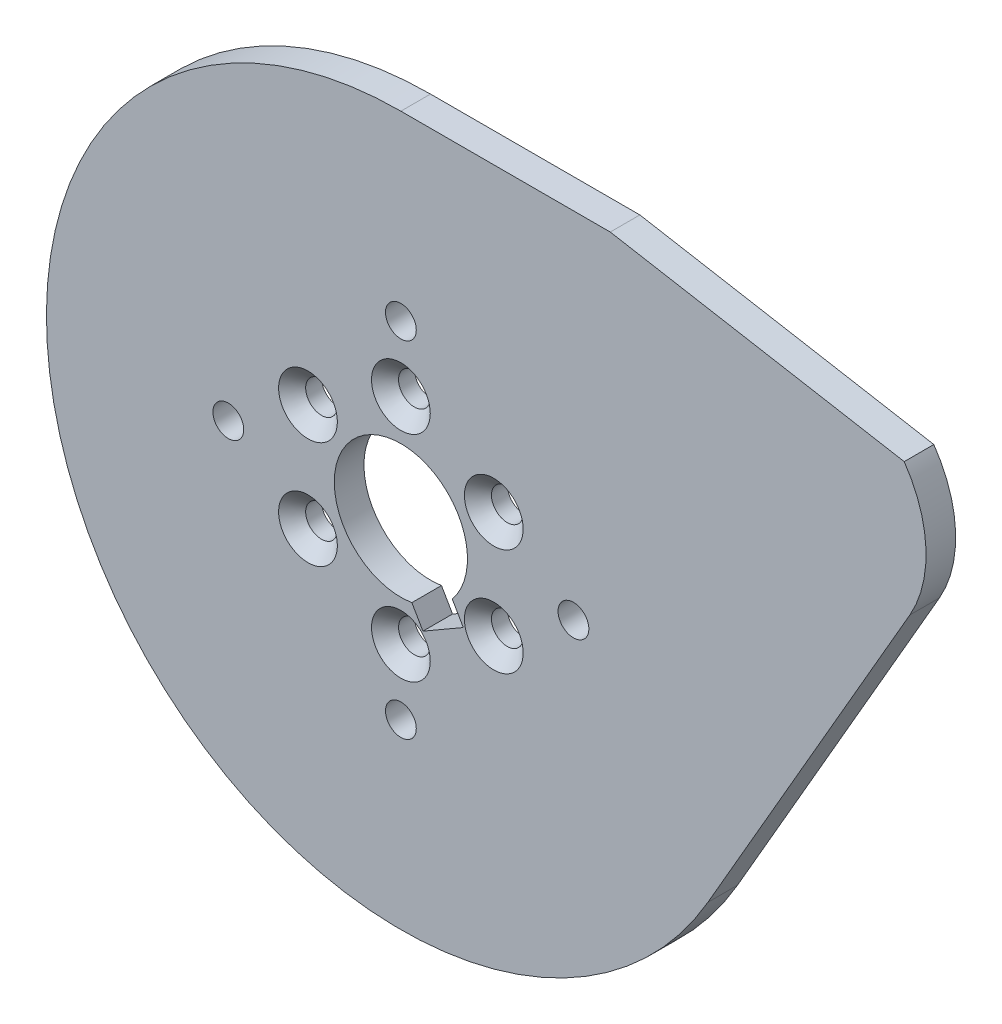
ISO-10303-21;
HEADER;
FILE_DESCRIPTION(('STEP AP214'),'2;1');
FILE_NAME('part.step','',(''),(''),'','','');
FILE_SCHEMA(('AUTOMOTIVE_DESIGN { 1 0 10303 214 1 1 1 1 }'));
ENDSEC;
DATA;
#1=APPLICATION_CONTEXT('core data for automotive mechanical design processes');
#2=APPLICATION_PROTOCOL_DEFINITION('international standard','automotive_design',2000,#1);
#3=PRODUCT_CONTEXT('',#1,'mechanical');
#4=PRODUCT('Part','Part','',(#3));
#5=PRODUCT_RELATED_PRODUCT_CATEGORY('part','',(#4));
#6=PRODUCT_DEFINITION_FORMATION('','',#4);
#7=PRODUCT_DEFINITION_CONTEXT('part definition',#1,'design');
#8=PRODUCT_DEFINITION('design','',#6,#7);
#9=PRODUCT_DEFINITION_SHAPE('','',#8);
#10=(LENGTH_UNIT() NAMED_UNIT(*) SI_UNIT(.MILLI.,.METRE.));
#11=(NAMED_UNIT(*) PLANE_ANGLE_UNIT() SI_UNIT($,.RADIAN.));
#12=(NAMED_UNIT(*) SI_UNIT($,.STERADIAN.) SOLID_ANGLE_UNIT());
#13=UNCERTAINTY_MEASURE_WITH_UNIT(LENGTH_MEASURE(1.E-05),#10,'distance_accuracy_value','');
#14=(GEOMETRIC_REPRESENTATION_CONTEXT(3) GLOBAL_UNCERTAINTY_ASSIGNED_CONTEXT((#13)) GLOBAL_UNIT_ASSIGNED_CONTEXT((#10,
#11,#12)) REPRESENTATION_CONTEXT('',''));
#15=CARTESIAN_POINT('',(0.,0.,0.));
#16=DIRECTION('',(0.,0.,1.));
#17=DIRECTION('',(1.,0.,0.));
#18=AXIS2_PLACEMENT_3D('',#15,#16,#17);
#19=CARTESIAN_POINT('',(0.,1.23512311489549E-12,0.));
#20=DIRECTION('',(0.,0.,1.));
#21=DIRECTION('',(1.,0.,0.));
#22=AXIS2_PLACEMENT_3D('',#19,#20,#21);
#23=CYLINDRICAL_SURFACE('',#22,38.0000000000004);
#24=CARTESIAN_POINT('',(0.,1.23512311489549E-12,3.175));
#25=DIRECTION('',(0.,0.,1.));
#26=DIRECTION('',(1.,0.,0.));
#27=AXIS2_PLACEMENT_3D('',#24,#25,#26);
#28=CIRCLE('',#27,38.0000000000004);
#29=CARTESIAN_POINT('',(0.,38.0000000000014,3.175));
#30=VERTEX_POINT('',#29);
#31=CARTESIAN_POINT('',(32.9089653438092,-18.9999999999992,3.175));
#32=VERTEX_POINT('',#31);
#33=EDGE_CURVE('E111',#30,#32,#28,.T.);
#34=ORIENTED_EDGE('',*,*,#33,.F.);
#35=DIRECTION('',(0.,0.,1.));
#36=VECTOR('',#35,1.);
#37=CARTESIAN_POINT('',(0.,38.0000000000014,0.));
#38=LINE('',#37,#36);
#39=CARTESIAN_POINT('',(0.,38.0000000000014,0.));
#40=VERTEX_POINT('',#39);
#41=EDGE_CURVE('E11',#40,#30,#38,.T.);
#42=ORIENTED_EDGE('',*,*,#41,.F.);
#43=CARTESIAN_POINT('',(0.,1.23512311489549E-12,0.));
#44=DIRECTION('',(0.,0.,1.));
#45=DIRECTION('',(1.,0.,0.));
#46=AXIS2_PLACEMENT_3D('',#43,#44,#45);
#47=CIRCLE('',#46,38.0000000000004);
#48=CARTESIAN_POINT('',(32.9089653438092,-18.9999999999992,0.));
#49=VERTEX_POINT('',#48);
#50=EDGE_CURVE('E141',#40,#49,#47,.T.);
#51=ORIENTED_EDGE('',*,*,#50,.T.);
#52=DIRECTION('',(0.,0.,1.));
#53=VECTOR('',#52,1.);
#54=CARTESIAN_POINT('',(32.9089653438092,-18.9999999999992,0.));
#55=LINE('',#54,#53);
#56=EDGE_CURVE('E37',#49,#32,#55,.T.);
#57=ORIENTED_EDGE('',*,*,#56,.T.);
#58=EDGE_LOOP('',(#34,#42,#51,#57));
#59=FACE_BOUND('',#58,.T.);
#60=ADVANCED_FACE('F34',(#59),#23,.T.);
#61=CARTESIAN_POINT('',(22.4456539190408,38.0000000000013,0.));
#62=DIRECTION('',(0.,1.,0.));
#63=DIRECTION('',(-1.,0.,0.));
#64=AXIS2_PLACEMENT_3D('',#61,#62,#63);
#65=PLANE('',#64);
#66=DIRECTION('',(-1.,0.,0.));
#67=VECTOR('',#66,1.);
#68=CARTESIAN_POINT('',(22.4456539190408,38.0000000000013,3.175));
#69=LINE('',#68,#67);
#70=CARTESIAN_POINT('',(22.4456539190408,38.0000000000013,3.175));
#71=VERTEX_POINT('',#70);
#72=EDGE_CURVE('E145',#71,#30,#69,.T.);
#73=ORIENTED_EDGE('',*,*,#72,.F.);
#74=DIRECTION('',(0.,0.,1.));
#75=VECTOR('',#74,1.);
#76=CARTESIAN_POINT('',(22.4456539190408,38.0000000000013,0.));
#77=LINE('',#76,#75);
#78=CARTESIAN_POINT('',(22.4456539190408,38.0000000000013,0.));
#79=VERTEX_POINT('',#78);
#80=EDGE_CURVE('E42',#79,#71,#77,.T.);
#81=ORIENTED_EDGE('',*,*,#80,.F.);
#82=DIRECTION('',(-1.,0.,0.));
#83=VECTOR('',#82,1.);
#84=CARTESIAN_POINT('',(22.4456539190408,38.0000000000013,0.));
#85=LINE('',#84,#83);
#86=EDGE_CURVE('E154',#79,#40,#85,.T.);
#87=ORIENTED_EDGE('',*,*,#86,.T.);
#88=ORIENTED_EDGE('',*,*,#41,.T.);
#89=EDGE_LOOP('',(#73,#81,#87,#88));
#90=FACE_BOUND('',#89,.T.);
#91=ADVANCED_FACE('F186',(#90),#65,.T.);
#92=CARTESIAN_POINT('',(53.9595020154317,32.4432583146595,0.));
#93=DIRECTION('',(0.173648177666931,0.984807753012208,0.));
#94=DIRECTION('',(-0.984807753012208,0.173648177666931,0.));
#95=AXIS2_PLACEMENT_3D('',#92,#93,#94);
#96=PLANE('',#95);
#97=DIRECTION('',(-0.984807753012208,0.173648177666931,0.));
#98=VECTOR('',#97,1.);
#99=CARTESIAN_POINT('',(53.9595020154317,32.4432583146595,3.175));
#100=LINE('',#99,#98);
#101=CARTESIAN_POINT('',(53.9595020154317,32.4432583146595,3.175));
#102=VERTEX_POINT('',#101);
#103=EDGE_CURVE('E165',#102,#71,#100,.T.);
#104=ORIENTED_EDGE('',*,*,#103,.F.);
#105=DIRECTION('',(0.,0.,1.));
#106=VECTOR('',#105,1.);
#107=CARTESIAN_POINT('',(53.9595020154317,32.4432583146595,0.));
#108=LINE('',#107,#106);
#109=CARTESIAN_POINT('',(53.9595020154317,32.4432583146595,0.));
#110=VERTEX_POINT('',#109);
#111=EDGE_CURVE('E171',#110,#102,#108,.T.);
#112=ORIENTED_EDGE('',*,*,#111,.F.);
#113=DIRECTION('',(-0.984807753012208,0.173648177666931,0.));
#114=VECTOR('',#113,1.);
#115=CARTESIAN_POINT('',(53.9595020154317,32.4432583146595,0.));
#116=LINE('',#115,#114);
#117=EDGE_CURVE('E151',#110,#79,#116,.T.);
#118=ORIENTED_EDGE('',*,*,#117,.T.);
#119=ORIENTED_EDGE('',*,*,#80,.T.);
#120=EDGE_LOOP('',(#104,#112,#118,#119));
#121=FACE_BOUND('',#120,.T.);
#122=ADVANCED_FACE('F193',(#121),#96,.T.);
#123=CARTESIAN_POINT('',(43.3012701892193,24.9999999999999,0.));
#124=DIRECTION('',(0.,0.,1.));
#125=DIRECTION('',(1.,0.,0.));
#126=AXIS2_PLACEMENT_3D('',#123,#124,#125);
#127=CYLINDRICAL_SURFACE('',#126,13.0000000000015);
#128=CARTESIAN_POINT('',(43.3012701892193,24.9999999999999,3.175));
#129=DIRECTION('',(0.,0.,1.));
#130=DIRECTION('',(1.,0.,0.));
#131=AXIS2_PLACEMENT_3D('',#128,#129,#130);
#132=CIRCLE('',#131,13.0000000000015);
#133=CARTESIAN_POINT('',(54.5596004384183,18.4999999999993,3.175));
#134=VERTEX_POINT('',#133);
#135=EDGE_CURVE('E162',#134,#102,#132,.T.);
#136=ORIENTED_EDGE('',*,*,#135,.F.);
#137=DIRECTION('',(0.,0.,1.));
#138=VECTOR('',#137,1.);
#139=CARTESIAN_POINT('',(54.5596004384183,18.4999999999993,0.));
#140=LINE('',#139,#138);
#141=CARTESIAN_POINT('',(54.5596004384183,18.4999999999993,0.));
#142=VERTEX_POINT('',#141);
#143=EDGE_CURVE('E172',#142,#134,#140,.T.);
#144=ORIENTED_EDGE('',*,*,#143,.F.);
#145=CARTESIAN_POINT('',(43.3012701892193,24.9999999999999,0.));
#146=DIRECTION('',(0.,0.,1.));
#147=DIRECTION('',(1.,0.,0.));
#148=AXIS2_PLACEMENT_3D('',#145,#146,#147);
#149=CIRCLE('',#148,13.0000000000015);
#150=EDGE_CURVE('E148',#142,#110,#149,.T.);
#151=ORIENTED_EDGE('',*,*,#150,.T.);
#152=ORIENTED_EDGE('',*,*,#111,.T.);
#153=EDGE_LOOP('',(#136,#144,#151,#152));
#154=FACE_BOUND('',#153,.T.);
#155=ADVANCED_FACE('F191',(#154),#127,.T.);
#156=CARTESIAN_POINT('',(32.9089653438092,-18.9999999999992,0.));
#157=DIRECTION('',(0.866025403784447,-0.499999999999986,0.));
#158=DIRECTION('',(0.499999999999986,0.866025403784447,0.));
#159=AXIS2_PLACEMENT_3D('',#156,#157,#158);
#160=PLANE('',#159);
#161=DIRECTION('',(0.499999999999986,0.866025403784447,0.));
#162=VECTOR('',#161,1.);
#163=CARTESIAN_POINT('',(32.9089653438092,-18.9999999999992,3.175));
#164=LINE('',#163,#162);
#165=EDGE_CURVE('E159',#32,#134,#164,.T.);
#166=ORIENTED_EDGE('',*,*,#165,.F.);
#167=ORIENTED_EDGE('',*,*,#56,.F.);
#168=DIRECTION('',(0.499999999999986,0.866025403784447,0.));
#169=VECTOR('',#168,1.);
#170=CARTESIAN_POINT('',(32.9089653438092,-18.9999999999992,0.));
#171=LINE('',#170,#169);
#172=EDGE_CURVE('E144',#49,#142,#171,.T.);
#173=ORIENTED_EDGE('',*,*,#172,.T.);
#174=ORIENTED_EDGE('',*,*,#143,.T.);
#175=EDGE_LOOP('',(#166,#167,#173,#174));
#176=FACE_BOUND('',#175,.T.);
#177=ADVANCED_FACE('F180',(#176),#160,.T.);
#178=CARTESIAN_POINT('',(0.,1.23512311489549E-12,0.));
#179=DIRECTION('',(0.,0.,1.));
#180=DIRECTION('',(1.,0.,0.));
#181=AXIS2_PLACEMENT_3D('',#178,#179,#180);
#182=PLANE('',#181);
#183=CARTESIAN_POINT('',(-9.95929214352075,5.74999999999949,0.));
#184=DIRECTION('',(0.,0.,1.));
#185=DIRECTION('',(1.,0.,0.));
#186=AXIS2_PLACEMENT_3D('',#183,#184,#185);
#187=CIRCLE('',#186,1.69999999999997);
#188=CARTESIAN_POINT('',(-8.25929214352077,5.74999999999949,0.));
#189=VERTEX_POINT('',#188);
#190=EDGE_CURVE('E451',#189,#189,#187,.T.);
#191=ORIENTED_EDGE('',*,*,#190,.T.);
#192=EDGE_LOOP('',(#191));
#193=FACE_BOUND('',#192,.T.);
#194=CARTESIAN_POINT('',(-9.95929214352015,-5.75000000000052,0.));
#195=DIRECTION('',(0.,0.,1.));
#196=DIRECTION('',(1.,0.,0.));
#197=AXIS2_PLACEMENT_3D('',#194,#195,#196);
#198=CIRCLE('',#197,1.69999999999997);
#199=CARTESIAN_POINT('',(-8.25929214352017,-5.75000000000052,0.));
#200=VERTEX_POINT('',#199);
#201=EDGE_CURVE('E462',#200,#200,#198,.T.);
#202=ORIENTED_EDGE('',*,*,#201,.T.);
#203=EDGE_LOOP('',(#202));
#204=FACE_BOUND('',#203,.T.);
#205=CARTESIAN_POINT('',(1.19132134712707E-12,-11.5,0.));
#206=DIRECTION('',(0.,0.,1.));
#207=DIRECTION('',(1.,0.,0.));
#208=AXIS2_PLACEMENT_3D('',#205,#206,#207);
#209=CIRCLE('',#208,1.69999999999997);
#210=CARTESIAN_POINT('',(1.70000000000116,-11.5,0.));
#211=VERTEX_POINT('',#210);
#212=EDGE_CURVE('E471',#211,#211,#209,.T.);
#213=ORIENTED_EDGE('',*,*,#212,.T.);
#214=EDGE_LOOP('',(#213));
#215=FACE_BOUND('',#214,.T.);
#216=CARTESIAN_POINT('',(9.95929214352194,-5.74999999999948,0.));
#217=DIRECTION('',(0.,0.,1.));
#218=DIRECTION('',(1.,0.,0.));
#219=AXIS2_PLACEMENT_3D('',#216,#217,#218);
#220=CIRCLE('',#219,1.69999999999997);
#221=CARTESIAN_POINT('',(11.6592921435219,-5.74999999999948,0.));
#222=VERTEX_POINT('',#221);
#223=EDGE_CURVE('E480',#222,#222,#220,.T.);
#224=ORIENTED_EDGE('',*,*,#223,.T.);
#225=EDGE_LOOP('',(#224));
#226=FACE_BOUND('',#225,.T.);
#227=CARTESIAN_POINT('',(9.95929214352134,5.75000000000052,0.));
#228=DIRECTION('',(0.,0.,1.));
#229=DIRECTION('',(1.,0.,0.));
#230=AXIS2_PLACEMENT_3D('',#227,#228,#229);
#231=CIRCLE('',#230,1.69999999999997);
#232=CARTESIAN_POINT('',(11.6592921435213,5.75000000000052,0.));
#233=VERTEX_POINT('',#232);
#234=EDGE_CURVE('E489',#233,#233,#231,.T.);
#235=ORIENTED_EDGE('',*,*,#234,.T.);
#236=EDGE_LOOP('',(#235));
#237=FACE_BOUND('',#236,.T.);
#238=CARTESIAN_POINT('',(0.,11.5,0.));
#239=DIRECTION('',(0.,0.,1.));
#240=DIRECTION('',(1.,0.,0.));
#241=AXIS2_PLACEMENT_3D('',#238,#239,#240);
#242=CIRCLE('',#241,1.69999999999997);
#243=CARTESIAN_POINT('',(1.69999999999997,11.5,0.));
#244=VERTEX_POINT('',#243);
#245=EDGE_CURVE('E498',#244,#244,#242,.T.);
#246=ORIENTED_EDGE('',*,*,#245,.T.);
#247=EDGE_LOOP('',(#246));
#248=FACE_BOUND('',#247,.T.);
#249=CARTESIAN_POINT('',(18.5000000000006,5.80012052705115E-13,0.));
#250=DIRECTION('',(0.,0.,1.));
#251=DIRECTION('',(1.,0.,0.));
#252=AXIS2_PLACEMENT_3D('',#249,#250,#251);
#253=CIRCLE('',#252,1.64999999999997);
#254=CARTESIAN_POINT('',(20.1500000000005,5.80012052705115E-13,0.));
#255=VERTEX_POINT('',#254);
#256=EDGE_CURVE('E504',#255,#255,#253,.T.);
#257=ORIENTED_EDGE('',*,*,#256,.T.);
#258=EDGE_LOOP('',(#257));
#259=FACE_BOUND('',#258,.T.);
#260=CARTESIAN_POINT('',(1.16002410541023E-12,-18.5,0.));
#261=DIRECTION('',(0.,0.,1.));
#262=DIRECTION('',(1.,0.,0.));
#263=AXIS2_PLACEMENT_3D('',#260,#261,#262);
#264=CIRCLE('',#263,1.64999999999997);
#265=CARTESIAN_POINT('',(1.65000000000113,-18.5,0.));
#266=VERTEX_POINT('',#265);
#267=EDGE_CURVE('E510',#266,#266,#264,.T.);
#268=ORIENTED_EDGE('',*,*,#267,.T.);
#269=EDGE_LOOP('',(#268));
#270=FACE_BOUND('',#269,.T.);
#271=CARTESIAN_POINT('',(-18.4999999999994,-5.82277649283538E-13,0.));
#272=DIRECTION('',(0.,0.,1.));
#273=DIRECTION('',(1.,0.,0.));
#274=AXIS2_PLACEMENT_3D('',#271,#272,#273);
#275=CIRCLE('',#274,1.64999999999997);
#276=CARTESIAN_POINT('',(-16.8499999999994,-5.82277649283538E-13,0.));
#277=VERTEX_POINT('',#276);
#278=EDGE_CURVE('E516',#277,#277,#275,.T.);
#279=ORIENTED_EDGE('',*,*,#278,.T.);
#280=EDGE_LOOP('',(#279));
#281=FACE_BOUND('',#280,.T.);
#282=CARTESIAN_POINT('',(0.,18.5,0.));
#283=DIRECTION('',(0.,0.,1.));
#284=DIRECTION('',(1.,0.,0.));
#285=AXIS2_PLACEMENT_3D('',#282,#283,#284);
#286=CIRCLE('',#285,1.64999999999997);
#287=CARTESIAN_POINT('',(1.64999999999997,18.5,0.));
#288=VERTEX_POINT('',#287);
#289=EDGE_CURVE('E123',#288,#288,#286,.T.);
#290=ORIENTED_EDGE('',*,*,#289,.T.);
#291=EDGE_LOOP('',(#290));
#292=FACE_BOUND('',#291,.T.);
#293=DIRECTION('',(0.500000000000065,-0.866025403784401,0.));
#294=VECTOR('',#293,1.);
#295=CARTESIAN_POINT('',(5.50768518862296,-4.53959057878827,0.));
#296=LINE('',#295,#294);
#297=CARTESIAN_POINT('',(5.50768518862296,-4.53959057878827,0.));
#298=VERTEX_POINT('',#297);
#299=CARTESIAN_POINT('',(6.69431345718396,-6.59489102963305,0.));
#300=VERTEX_POINT('',#299);
#301=EDGE_CURVE('E122',#298,#300,#296,.T.);
#302=ORIENTED_EDGE('',*,*,#301,.F.);
#303=CARTESIAN_POINT('',(0.,0.,0.));
#304=DIRECTION('',(0.,0.,-1.));
#305=DIRECTION('',(-1.,0.,0.));
#306=AXIS2_PLACEMENT_3D('',#303,#304,#305);
#307=CIRCLE('',#306,7.1374);
#308=CARTESIAN_POINT('',(1.17755816970101,-7.03959057878869,0.));
#309=VERTEX_POINT('',#308);
#310=EDGE_CURVE('E50',#309,#298,#307,.T.);
#311=ORIENTED_EDGE('',*,*,#310,.F.);
#312=DIRECTION('',(-0.5,0.866025403784439,0.));
#313=VECTOR('',#312,1.);
#314=CARTESIAN_POINT('',(2.36418643826161,-9.09489102963314,0.));
#315=LINE('',#314,#313);
#316=CARTESIAN_POINT('',(2.36418643826161,-9.09489102963314,0.));
#317=VERTEX_POINT('',#316);
#318=EDGE_CURVE('E120',#317,#309,#315,.T.);
#319=ORIENTED_EDGE('',*,*,#318,.F.);
#320=DIRECTION('',(-0.866025403784439,-0.5,0.));
#321=VECTOR('',#320,1.);
#322=CARTESIAN_POINT('',(6.69431345718396,-6.59489102963305,0.));
#323=LINE('',#322,#321);
#324=EDGE_CURVE('E128',#300,#317,#323,.T.);
#325=ORIENTED_EDGE('',*,*,#324,.F.);
#326=EDGE_LOOP('',(#302,#311,#319,#325));
#327=FACE_BOUND('',#326,.T.);
#328=ORIENTED_EDGE('',*,*,#50,.F.);
#329=ORIENTED_EDGE('',*,*,#86,.F.);
#330=ORIENTED_EDGE('',*,*,#117,.F.);
#331=ORIENTED_EDGE('',*,*,#150,.F.);
#332=ORIENTED_EDGE('',*,*,#172,.F.);
#333=EDGE_LOOP('',(#328,#329,#330,#331,#332));
#334=FACE_BOUND('',#333,.T.);
#335=ADVANCED_FACE('F117',(#193,#204,#215,#226,#237,#248,#259,#270,#281,#292,#327,#334),#182,.F.);
#336=CARTESIAN_POINT('',(0.,1.23512311489549E-12,3.175));
#337=DIRECTION('',(0.,0.,1.));
#338=DIRECTION('',(1.,0.,0.));
#339=AXIS2_PLACEMENT_3D('',#336,#337,#338);
#340=PLANE('',#339);
#341=CARTESIAN_POINT('',(-9.95929214352075,5.74999999999949,3.175));
#342=DIRECTION('',(0.,0.,1.));
#343=DIRECTION('',(1.,0.,0.));
#344=AXIS2_PLACEMENT_3D('',#341,#342,#343);
#345=CIRCLE('',#344,3.1499999999771);
#346=CARTESIAN_POINT('',(-6.80929214354364,5.74999999999949,3.175));
#347=VERTEX_POINT('',#346);
#348=EDGE_CURVE('E449',#347,#347,#345,.T.);
#349=ORIENTED_EDGE('',*,*,#348,.F.);
#350=EDGE_LOOP('',(#349));
#351=FACE_BOUND('',#350,.T.);
#352=CARTESIAN_POINT('',(-9.95929214352015,-5.75000000000052,3.175));
#353=DIRECTION('',(0.,0.,1.));
#354=DIRECTION('',(1.,0.,0.));
#355=AXIS2_PLACEMENT_3D('',#352,#353,#354);
#356=CIRCLE('',#355,3.1499999999771);
#357=CARTESIAN_POINT('',(-6.80929214354305,-5.75000000000052,3.175));
#358=VERTEX_POINT('',#357);
#359=EDGE_CURVE('E456',#358,#358,#356,.T.);
#360=ORIENTED_EDGE('',*,*,#359,.F.);
#361=EDGE_LOOP('',(#360));
#362=FACE_BOUND('',#361,.T.);
#363=CARTESIAN_POINT('',(1.19132134712707E-12,-11.5,3.175));
#364=DIRECTION('',(0.,0.,1.));
#365=DIRECTION('',(1.,0.,0.));
#366=AXIS2_PLACEMENT_3D('',#363,#364,#365);
#367=CIRCLE('',#366,3.1499999999771);
#368=CARTESIAN_POINT('',(3.14999999997829,-11.5,3.175));
#369=VERTEX_POINT('',#368);
#370=EDGE_CURVE('E465',#369,#369,#367,.T.);
#371=ORIENTED_EDGE('',*,*,#370,.F.);
#372=EDGE_LOOP('',(#371));
#373=FACE_BOUND('',#372,.T.);
#374=CARTESIAN_POINT('',(9.95929214352194,-5.74999999999948,3.175));
#375=DIRECTION('',(0.,0.,1.));
#376=DIRECTION('',(1.,0.,0.));
#377=AXIS2_PLACEMENT_3D('',#374,#375,#376);
#378=CIRCLE('',#377,3.1499999999771);
#379=CARTESIAN_POINT('',(13.109292143499,-5.74999999999948,3.175));
#380=VERTEX_POINT('',#379);
#381=EDGE_CURVE('E474',#380,#380,#378,.T.);
#382=ORIENTED_EDGE('',*,*,#381,.F.);
#383=EDGE_LOOP('',(#382));
#384=FACE_BOUND('',#383,.T.);
#385=CARTESIAN_POINT('',(9.95929214352134,5.75000000000052,3.175));
#386=DIRECTION('',(0.,0.,1.));
#387=DIRECTION('',(1.,0.,0.));
#388=AXIS2_PLACEMENT_3D('',#385,#386,#387);
#389=CIRCLE('',#388,3.1499999999771);
#390=CARTESIAN_POINT('',(13.1092921434984,5.75000000000052,3.175));
#391=VERTEX_POINT('',#390);
#392=EDGE_CURVE('E483',#391,#391,#389,.T.);
#393=ORIENTED_EDGE('',*,*,#392,.F.);
#394=EDGE_LOOP('',(#393));
#395=FACE_BOUND('',#394,.T.);
#396=CARTESIAN_POINT('',(0.,11.5,3.175));
#397=DIRECTION('',(0.,0.,1.));
#398=DIRECTION('',(1.,0.,0.));
#399=AXIS2_PLACEMENT_3D('',#396,#397,#398);
#400=CIRCLE('',#399,3.1499999999771);
#401=CARTESIAN_POINT('',(3.1499999999771,11.5,3.175));
#402=VERTEX_POINT('',#401);
#403=EDGE_CURVE('E492',#402,#402,#400,.T.);
#404=ORIENTED_EDGE('',*,*,#403,.F.);
#405=EDGE_LOOP('',(#404));
#406=FACE_BOUND('',#405,.T.);
#407=CARTESIAN_POINT('',(18.5000000000006,5.80012052705115E-13,3.175));
#408=DIRECTION('',(0.,0.,1.));
#409=DIRECTION('',(1.,0.,0.));
#410=AXIS2_PLACEMENT_3D('',#407,#408,#409);
#411=CIRCLE('',#410,1.64999999999997);
#412=CARTESIAN_POINT('',(20.1500000000005,5.80012052705115E-13,3.175));
#413=VERTEX_POINT('',#412);
#414=EDGE_CURVE('E501',#413,#413,#411,.T.);
#415=ORIENTED_EDGE('',*,*,#414,.F.);
#416=EDGE_LOOP('',(#415));
#417=FACE_BOUND('',#416,.T.);
#418=CARTESIAN_POINT('',(1.16002410541023E-12,-18.5,3.175));
#419=DIRECTION('',(0.,0.,1.));
#420=DIRECTION('',(1.,0.,0.));
#421=AXIS2_PLACEMENT_3D('',#418,#419,#420);
#422=CIRCLE('',#421,1.64999999999997);
#423=CARTESIAN_POINT('',(1.65000000000113,-18.5,3.175));
#424=VERTEX_POINT('',#423);
#425=EDGE_CURVE('E507',#424,#424,#422,.T.);
#426=ORIENTED_EDGE('',*,*,#425,.F.);
#427=EDGE_LOOP('',(#426));
#428=FACE_BOUND('',#427,.T.);
#429=CARTESIAN_POINT('',(-18.4999999999994,-5.82277649283538E-13,3.175));
#430=DIRECTION('',(0.,0.,1.));
#431=DIRECTION('',(1.,0.,0.));
#432=AXIS2_PLACEMENT_3D('',#429,#430,#431);
#433=CIRCLE('',#432,1.64999999999997);
#434=CARTESIAN_POINT('',(-16.8499999999994,-5.82277649283538E-13,3.175));
#435=VERTEX_POINT('',#434);
#436=EDGE_CURVE('E513',#435,#435,#433,.T.);
#437=ORIENTED_EDGE('',*,*,#436,.F.);
#438=EDGE_LOOP('',(#437));
#439=FACE_BOUND('',#438,.T.);
#440=CARTESIAN_POINT('',(0.,18.5,3.175));
#441=DIRECTION('',(0.,0.,1.));
#442=DIRECTION('',(1.,0.,0.));
#443=AXIS2_PLACEMENT_3D('',#440,#441,#442);
#444=CIRCLE('',#443,1.64999999999997);
#445=CARTESIAN_POINT('',(1.64999999999997,18.5,3.175));
#446=VERTEX_POINT('',#445);
#447=EDGE_CURVE('E519',#446,#446,#444,.T.);
#448=ORIENTED_EDGE('',*,*,#447,.F.);
#449=EDGE_LOOP('',(#448));
#450=FACE_BOUND('',#449,.T.);
#451=CARTESIAN_POINT('',(0.,0.,3.175));
#452=DIRECTION('',(0.,0.,-1.));
#453=DIRECTION('',(-1.,0.,0.));
#454=AXIS2_PLACEMENT_3D('',#451,#452,#453);
#455=CIRCLE('',#454,7.1374);
#456=CARTESIAN_POINT('',(1.17755816970101,-7.03959057878869,3.175));
#457=VERTEX_POINT('',#456);
#458=CARTESIAN_POINT('',(5.50768518862296,-4.53959057878827,3.175));
#459=VERTEX_POINT('',#458);
#460=EDGE_CURVE('E106',#457,#459,#455,.T.);
#461=ORIENTED_EDGE('',*,*,#460,.T.);
#462=DIRECTION('',(0.500000000000065,-0.866025403784401,0.));
#463=VECTOR('',#462,1.);
#464=CARTESIAN_POINT('',(5.50768518862296,-4.53959057878827,3.175));
#465=LINE('',#464,#463);
#466=CARTESIAN_POINT('',(6.69431345718396,-6.59489102963305,3.175));
#467=VERTEX_POINT('',#466);
#468=EDGE_CURVE('E127',#459,#467,#465,.T.);
#469=ORIENTED_EDGE('',*,*,#468,.T.);
#470=DIRECTION('',(-0.866025403784439,-0.5,0.));
#471=VECTOR('',#470,1.);
#472=CARTESIAN_POINT('',(6.69431345718396,-6.59489102963305,3.175));
#473=LINE('',#472,#471);
#474=CARTESIAN_POINT('',(2.36418643826161,-9.09489102963314,3.175));
#475=VERTEX_POINT('',#474);
#476=EDGE_CURVE('E58',#467,#475,#473,.T.);
#477=ORIENTED_EDGE('',*,*,#476,.T.);
#478=DIRECTION('',(-0.5,0.866025403784439,0.));
#479=VECTOR('',#478,1.);
#480=CARTESIAN_POINT('',(2.36418643826161,-9.09489102963314,3.175));
#481=LINE('',#480,#479);
#482=EDGE_CURVE('E140',#475,#457,#481,.T.);
#483=ORIENTED_EDGE('',*,*,#482,.T.);
#484=EDGE_LOOP('',(#461,#469,#477,#483));
#485=FACE_BOUND('',#484,.T.);
#486=ORIENTED_EDGE('',*,*,#33,.T.);
#487=ORIENTED_EDGE('',*,*,#165,.T.);
#488=ORIENTED_EDGE('',*,*,#135,.T.);
#489=ORIENTED_EDGE('',*,*,#103,.T.);
#490=ORIENTED_EDGE('',*,*,#72,.T.);
#491=EDGE_LOOP('',(#486,#487,#488,#489,#490));
#492=FACE_BOUND('',#491,.T.);
#493=ADVANCED_FACE('F182',(#351,#362,#373,#384,#395,#406,#417,#428,#439,#450,#485,#492),#340,.T.);
#494=CARTESIAN_POINT('',(2.36418643826161,-9.09489102963314,3.175));
#495=DIRECTION('',(-0.866025403784439,-0.5,0.));
#496=DIRECTION('',(0.5,-0.866025403784439,0.));
#497=AXIS2_PLACEMENT_3D('',#494,#495,#496);
#498=PLANE('',#497);
#499=ORIENTED_EDGE('',*,*,#318,.T.);
#500=DIRECTION('',(0.,0.,-1.));
#501=VECTOR('',#500,1.);
#502=CARTESIAN_POINT('',(1.17755816970101,-7.03959057878869,3.175));
#503=LINE('',#502,#501);
#504=EDGE_CURVE('E103',#457,#309,#503,.T.);
#505=ORIENTED_EDGE('',*,*,#504,.F.);
#506=ORIENTED_EDGE('',*,*,#482,.F.);
#507=DIRECTION('',(0.,0.,-1.));
#508=VECTOR('',#507,1.);
#509=CARTESIAN_POINT('',(2.36418643826161,-9.09489102963314,3.175));
#510=LINE('',#509,#508);
#511=EDGE_CURVE('E112',#475,#317,#510,.T.);
#512=ORIENTED_EDGE('',*,*,#511,.T.);
#513=EDGE_LOOP('',(#499,#505,#506,#512));
#514=FACE_BOUND('',#513,.T.);
#515=ADVANCED_FACE('F125',(#514),#498,.F.);
#516=CARTESIAN_POINT('',(6.69431345718396,-6.59489102963305,3.175));
#517=DIRECTION('',(0.5,-0.866025403784439,0.));
#518=DIRECTION('',(0.866025403784439,0.5,0.));
#519=AXIS2_PLACEMENT_3D('',#516,#517,#518);
#520=PLANE('',#519);
#521=ORIENTED_EDGE('',*,*,#324,.T.);
#522=ORIENTED_EDGE('',*,*,#511,.F.);
#523=ORIENTED_EDGE('',*,*,#476,.F.);
#524=DIRECTION('',(0.,0.,-1.));
#525=VECTOR('',#524,1.);
#526=CARTESIAN_POINT('',(6.69431345718396,-6.59489102963305,3.175));
#527=LINE('',#526,#525);
#528=EDGE_CURVE('E136',#467,#300,#527,.T.);
#529=ORIENTED_EDGE('',*,*,#528,.T.);
#530=EDGE_LOOP('',(#521,#522,#523,#529));
#531=FACE_BOUND('',#530,.T.);
#532=ADVANCED_FACE('F233',(#531),#520,.F.);
#533=CARTESIAN_POINT('',(5.50768518862296,-4.53959057878827,3.175));
#534=DIRECTION('',(0.866025403784401,0.500000000000065,0.));
#535=DIRECTION('',(-0.500000000000065,0.866025403784401,0.));
#536=AXIS2_PLACEMENT_3D('',#533,#534,#535);
#537=PLANE('',#536);
#538=ORIENTED_EDGE('',*,*,#301,.T.);
#539=ORIENTED_EDGE('',*,*,#528,.F.);
#540=ORIENTED_EDGE('',*,*,#468,.F.);
#541=DIRECTION('',(0.,0.,-1.));
#542=VECTOR('',#541,1.);
#543=CARTESIAN_POINT('',(5.50768518862296,-4.53959057878827,3.175));
#544=LINE('',#543,#542);
#545=EDGE_CURVE('E138',#459,#298,#544,.T.);
#546=ORIENTED_EDGE('',*,*,#545,.T.);
#547=EDGE_LOOP('',(#538,#539,#540,#546));
#548=FACE_BOUND('',#547,.T.);
#549=ADVANCED_FACE('F238',(#548),#537,.F.);
#550=CARTESIAN_POINT('',(0.,0.,3.175));
#551=DIRECTION('',(0.,0.,-1.));
#552=DIRECTION('',(-1.,0.,0.));
#553=AXIS2_PLACEMENT_3D('',#550,#551,#552);
#554=CYLINDRICAL_SURFACE('',#553,7.1374);
#555=ORIENTED_EDGE('',*,*,#310,.T.);
#556=ORIENTED_EDGE('',*,*,#545,.F.);
#557=ORIENTED_EDGE('',*,*,#460,.F.);
#558=ORIENTED_EDGE('',*,*,#504,.T.);
#559=EDGE_LOOP('',(#555,#556,#557,#558));
#560=FACE_BOUND('',#559,.T.);
#561=ADVANCED_FACE('F104',(#560),#554,.F.);
#562=CARTESIAN_POINT('',(0.,18.5,3.175));
#563=DIRECTION('',(0.,0.,1.));
#564=DIRECTION('',(1.,0.,0.));
#565=AXIS2_PLACEMENT_3D('',#562,#563,#564);
#566=CYLINDRICAL_SURFACE('',#565,1.64999999999997);
#567=ORIENTED_EDGE('',*,*,#289,.F.);
#568=EDGE_LOOP('',(#567));
#569=FACE_BOUND('',#568,.T.);
#570=ORIENTED_EDGE('',*,*,#447,.T.);
#571=EDGE_LOOP('',(#570));
#572=FACE_BOUND('',#571,.T.);
#573=ADVANCED_FACE('F266',(#569,#572),#566,.F.);
#574=CARTESIAN_POINT('',(-18.4999999999994,-5.82277649283538E-13,3.175));
#575=DIRECTION('',(0.,0.,1.));
#576=DIRECTION('',(1.,0.,0.));
#577=AXIS2_PLACEMENT_3D('',#574,#575,#576);
#578=CYLINDRICAL_SURFACE('',#577,1.64999999999997);
#579=ORIENTED_EDGE('',*,*,#278,.F.);
#580=EDGE_LOOP('',(#579));
#581=FACE_BOUND('',#580,.T.);
#582=ORIENTED_EDGE('',*,*,#436,.T.);
#583=EDGE_LOOP('',(#582));
#584=FACE_BOUND('',#583,.T.);
#585=ADVANCED_FACE('F275',(#581,#584),#578,.F.);
#586=CARTESIAN_POINT('',(1.16002410541023E-12,-18.5,3.175));
#587=DIRECTION('',(0.,0.,1.));
#588=DIRECTION('',(1.,0.,0.));
#589=AXIS2_PLACEMENT_3D('',#586,#587,#588);
#590=CYLINDRICAL_SURFACE('',#589,1.64999999999997);
#591=ORIENTED_EDGE('',*,*,#267,.F.);
#592=EDGE_LOOP('',(#591));
#593=FACE_BOUND('',#592,.T.);
#594=ORIENTED_EDGE('',*,*,#425,.T.);
#595=EDGE_LOOP('',(#594));
#596=FACE_BOUND('',#595,.T.);
#597=ADVANCED_FACE('F285',(#593,#596),#590,.F.);
#598=CARTESIAN_POINT('',(18.5000000000006,5.80012052705115E-13,3.175));
#599=DIRECTION('',(0.,0.,1.));
#600=DIRECTION('',(1.,0.,0.));
#601=AXIS2_PLACEMENT_3D('',#598,#599,#600);
#602=CYLINDRICAL_SURFACE('',#601,1.64999999999997);
#603=ORIENTED_EDGE('',*,*,#256,.F.);
#604=EDGE_LOOP('',(#603));
#605=FACE_BOUND('',#604,.T.);
#606=ORIENTED_EDGE('',*,*,#414,.T.);
#607=EDGE_LOOP('',(#606));
#608=FACE_BOUND('',#607,.T.);
#609=ADVANCED_FACE('F295',(#605,#608),#602,.F.);
#610=CARTESIAN_POINT('',(0.,11.5,3.175));
#611=DIRECTION('',(0.,0.,1.));
#612=DIRECTION('',(1.,0.,0.));
#613=AXIS2_PLACEMENT_3D('',#610,#611,#612);
#614=CYLINDRICAL_SURFACE('',#613,1.69999999999997);
#615=ORIENTED_EDGE('',*,*,#245,.F.);
#616=EDGE_LOOP('',(#615));
#617=FACE_BOUND('',#616,.T.);
#618=CARTESIAN_POINT('',(0.,11.5,1.72499999996603));
#619=DIRECTION('',(0.,0.,1.));
#620=DIRECTION('',(1.,0.,0.));
#621=AXIS2_PLACEMENT_3D('',#618,#619,#620);
#622=CIRCLE('',#621,1.69999999999997);
#623=CARTESIAN_POINT('',(1.69999999999997,11.5,1.72499999996603));
#624=VERTEX_POINT('',#623);
#625=EDGE_CURVE('E495',#624,#624,#622,.T.);
#626=ORIENTED_EDGE('',*,*,#625,.T.);
#627=EDGE_LOOP('',(#626));
#628=FACE_BOUND('',#627,.T.);
#629=ADVANCED_FACE('F305',(#617,#628),#614,.F.);
#630=CARTESIAN_POINT('',(0.,11.5,3.175));
#631=DIRECTION('',(0.,0.,1.));
#632=DIRECTION('',(1.,0.,0.));
#633=AXIS2_PLACEMENT_3D('',#630,#631,#632);
#634=CONICAL_SURFACE('',#633,3.1499999999771,0.785398163377849);
#635=ORIENTED_EDGE('',*,*,#625,.F.);
#636=EDGE_LOOP('',(#635));
#637=FACE_BOUND('',#636,.T.);
#638=ORIENTED_EDGE('',*,*,#403,.T.);
#639=EDGE_LOOP('',(#638));
#640=FACE_BOUND('',#639,.T.);
#641=ADVANCED_FACE('F329',(#637,#640),#634,.F.);
#642=CARTESIAN_POINT('',(9.95929214352134,5.75000000000052,3.175));
#643=DIRECTION('',(0.,0.,1.));
#644=DIRECTION('',(1.,0.,0.));
#645=AXIS2_PLACEMENT_3D('',#642,#643,#644);
#646=CYLINDRICAL_SURFACE('',#645,1.69999999999997);
#647=ORIENTED_EDGE('',*,*,#234,.F.);
#648=EDGE_LOOP('',(#647));
#649=FACE_BOUND('',#648,.T.);
#650=CARTESIAN_POINT('',(9.95929214352134,5.75000000000052,1.72499999996603));
#651=DIRECTION('',(0.,0.,1.));
#652=DIRECTION('',(1.,0.,0.));
#653=AXIS2_PLACEMENT_3D('',#650,#651,#652);
#654=CIRCLE('',#653,1.69999999999997);
#655=CARTESIAN_POINT('',(11.6592921435213,5.75000000000052,1.72499999996603));
#656=VERTEX_POINT('',#655);
#657=EDGE_CURVE('E486',#656,#656,#654,.T.);
#658=ORIENTED_EDGE('',*,*,#657,.T.);
#659=EDGE_LOOP('',(#658));
#660=FACE_BOUND('',#659,.T.);
#661=ADVANCED_FACE('F339',(#649,#660),#646,.F.);
#662=CARTESIAN_POINT('',(9.95929214352134,5.75000000000052,3.175));
#663=DIRECTION('',(0.,0.,1.));
#664=DIRECTION('',(1.,0.,0.));
#665=AXIS2_PLACEMENT_3D('',#662,#663,#664);
#666=CONICAL_SURFACE('',#665,3.1499999999771,0.785398163377849);
#667=ORIENTED_EDGE('',*,*,#657,.F.);
#668=EDGE_LOOP('',(#667));
#669=FACE_BOUND('',#668,.T.);
#670=ORIENTED_EDGE('',*,*,#392,.T.);
#671=EDGE_LOOP('',(#670));
#672=FACE_BOUND('',#671,.T.);
#673=ADVANCED_FACE('F349',(#669,#672),#666,.F.);
#674=CARTESIAN_POINT('',(9.95929214352194,-5.74999999999948,3.175));
#675=DIRECTION('',(0.,0.,1.));
#676=DIRECTION('',(1.,0.,0.));
#677=AXIS2_PLACEMENT_3D('',#674,#675,#676);
#678=CYLINDRICAL_SURFACE('',#677,1.69999999999997);
#679=ORIENTED_EDGE('',*,*,#223,.F.);
#680=EDGE_LOOP('',(#679));
#681=FACE_BOUND('',#680,.T.);
#682=CARTESIAN_POINT('',(9.95929214352194,-5.74999999999948,1.72499999996603));
#683=DIRECTION('',(0.,0.,1.));
#684=DIRECTION('',(1.,0.,0.));
#685=AXIS2_PLACEMENT_3D('',#682,#683,#684);
#686=CIRCLE('',#685,1.69999999999997);
#687=CARTESIAN_POINT('',(11.6592921435219,-5.74999999999948,1.72499999996603));
#688=VERTEX_POINT('',#687);
#689=EDGE_CURVE('E477',#688,#688,#686,.T.);
#690=ORIENTED_EDGE('',*,*,#689,.T.);
#691=EDGE_LOOP('',(#690));
#692=FACE_BOUND('',#691,.T.);
#693=ADVANCED_FACE('F359',(#681,#692),#678,.F.);
#694=CARTESIAN_POINT('',(9.95929214352194,-5.74999999999948,3.175));
#695=DIRECTION('',(0.,0.,1.));
#696=DIRECTION('',(1.,0.,0.));
#697=AXIS2_PLACEMENT_3D('',#694,#695,#696);
#698=CONICAL_SURFACE('',#697,3.1499999999771,0.785398163377849);
#699=ORIENTED_EDGE('',*,*,#689,.F.);
#700=EDGE_LOOP('',(#699));
#701=FACE_BOUND('',#700,.T.);
#702=ORIENTED_EDGE('',*,*,#381,.T.);
#703=EDGE_LOOP('',(#702));
#704=FACE_BOUND('',#703,.T.);
#705=ADVANCED_FACE('F369',(#701,#704),#698,.F.);
#706=CARTESIAN_POINT('',(1.19132134712707E-12,-11.5,3.175));
#707=DIRECTION('',(0.,0.,1.));
#708=DIRECTION('',(1.,0.,0.));
#709=AXIS2_PLACEMENT_3D('',#706,#707,#708);
#710=CYLINDRICAL_SURFACE('',#709,1.69999999999997);
#711=ORIENTED_EDGE('',*,*,#212,.F.);
#712=EDGE_LOOP('',(#711));
#713=FACE_BOUND('',#712,.T.);
#714=CARTESIAN_POINT('',(1.19132134712707E-12,-11.5,1.72499999996603));
#715=DIRECTION('',(0.,0.,1.));
#716=DIRECTION('',(1.,0.,0.));
#717=AXIS2_PLACEMENT_3D('',#714,#715,#716);
#718=CIRCLE('',#717,1.69999999999997);
#719=CARTESIAN_POINT('',(1.70000000000117,-11.5,1.72499999996603));
#720=VERTEX_POINT('',#719);
#721=EDGE_CURVE('E468',#720,#720,#718,.T.);
#722=ORIENTED_EDGE('',*,*,#721,.T.);
#723=EDGE_LOOP('',(#722));
#724=FACE_BOUND('',#723,.T.);
#725=ADVANCED_FACE('F379',(#713,#724),#710,.F.);
#726=CARTESIAN_POINT('',(1.19132134712707E-12,-11.5,3.175));
#727=DIRECTION('',(0.,0.,1.));
#728=DIRECTION('',(1.,0.,0.));
#729=AXIS2_PLACEMENT_3D('',#726,#727,#728);
#730=CONICAL_SURFACE('',#729,3.1499999999771,0.785398163377849);
#731=ORIENTED_EDGE('',*,*,#721,.F.);
#732=EDGE_LOOP('',(#731));
#733=FACE_BOUND('',#732,.T.);
#734=ORIENTED_EDGE('',*,*,#370,.T.);
#735=EDGE_LOOP('',(#734));
#736=FACE_BOUND('',#735,.T.);
#737=ADVANCED_FACE('F389',(#733,#736),#730,.F.);
#738=CARTESIAN_POINT('',(-9.95929214352015,-5.75000000000052,3.175));
#739=DIRECTION('',(0.,0.,1.));
#740=DIRECTION('',(1.,0.,0.));
#741=AXIS2_PLACEMENT_3D('',#738,#739,#740);
#742=CYLINDRICAL_SURFACE('',#741,1.69999999999997);
#743=ORIENTED_EDGE('',*,*,#201,.F.);
#744=EDGE_LOOP('',(#743));
#745=FACE_BOUND('',#744,.T.);
#746=CARTESIAN_POINT('',(-9.95929214352015,-5.75000000000052,1.72499999996603));
#747=DIRECTION('',(0.,0.,1.));
#748=DIRECTION('',(1.,0.,0.));
#749=AXIS2_PLACEMENT_3D('',#746,#747,#748);
#750=CIRCLE('',#749,1.69999999999997);
#751=CARTESIAN_POINT('',(-8.25929214352017,-5.75000000000052,1.72499999996603));
#752=VERTEX_POINT('',#751);
#753=EDGE_CURVE('E459',#752,#752,#750,.T.);
#754=ORIENTED_EDGE('',*,*,#753,.T.);
#755=EDGE_LOOP('',(#754));
#756=FACE_BOUND('',#755,.T.);
#757=ADVANCED_FACE('F399',(#745,#756),#742,.F.);
#758=CARTESIAN_POINT('',(-9.95929214352015,-5.75000000000052,3.175));
#759=DIRECTION('',(0.,0.,1.));
#760=DIRECTION('',(1.,0.,0.));
#761=AXIS2_PLACEMENT_3D('',#758,#759,#760);
#762=CONICAL_SURFACE('',#761,3.1499999999771,0.785398163377849);
#763=ORIENTED_EDGE('',*,*,#753,.F.);
#764=EDGE_LOOP('',(#763));
#765=FACE_BOUND('',#764,.T.);
#766=ORIENTED_EDGE('',*,*,#359,.T.);
#767=EDGE_LOOP('',(#766));
#768=FACE_BOUND('',#767,.T.);
#769=ADVANCED_FACE('F409',(#765,#768),#762,.F.);
#770=CARTESIAN_POINT('',(-9.95929214352075,5.74999999999949,3.175));
#771=DIRECTION('',(0.,0.,1.));
#772=DIRECTION('',(1.,0.,0.));
#773=AXIS2_PLACEMENT_3D('',#770,#771,#772);
#774=CYLINDRICAL_SURFACE('',#773,1.69999999999997);
#775=ORIENTED_EDGE('',*,*,#190,.F.);
#776=EDGE_LOOP('',(#775));
#777=FACE_BOUND('',#776,.T.);
#778=CARTESIAN_POINT('',(-9.95929214352075,5.74999999999949,1.72499999996603));
#779=DIRECTION('',(0.,0.,1.));
#780=DIRECTION('',(1.,0.,0.));
#781=AXIS2_PLACEMENT_3D('',#778,#779,#780);
#782=CIRCLE('',#781,1.69999999999997);
#783=CARTESIAN_POINT('',(-8.25929214352077,5.74999999999949,1.72499999996603));
#784=VERTEX_POINT('',#783);
#785=EDGE_CURVE('E446',#784,#784,#782,.T.);
#786=ORIENTED_EDGE('',*,*,#785,.T.);
#787=EDGE_LOOP('',(#786));
#788=FACE_BOUND('',#787,.T.);
#789=ADVANCED_FACE('F419',(#777,#788),#774,.F.);
#790=CARTESIAN_POINT('',(-9.95929214352075,5.74999999999949,3.175));
#791=DIRECTION('',(0.,0.,1.));
#792=DIRECTION('',(1.,0.,0.));
#793=AXIS2_PLACEMENT_3D('',#790,#791,#792);
#794=CONICAL_SURFACE('',#793,3.1499999999771,0.785398163377849);
#795=ORIENTED_EDGE('',*,*,#785,.F.);
#796=EDGE_LOOP('',(#795));
#797=FACE_BOUND('',#796,.T.);
#798=ORIENTED_EDGE('',*,*,#348,.T.);
#799=EDGE_LOOP('',(#798));
#800=FACE_BOUND('',#799,.T.);
#801=ADVANCED_FACE('F429',(#797,#800),#794,.F.);
#802=CLOSED_SHELL('',(#60,#91,#122,#155,#177,#335,#493,#515,#532,#549,#561,#573,#585,#597,#609,
#629,#641,#661,#673,#693,#705,#725,#737,#757,#769,#789,#801));
#803=MANIFOLD_SOLID_BREP('B2',#802);
#804=ADVANCED_BREP_SHAPE_REPRESENTATION('',(#18,#803),#14);
#805=SHAPE_DEFINITION_REPRESENTATION(#9,#804);
ENDSEC;
END-ISO-10303-21;
